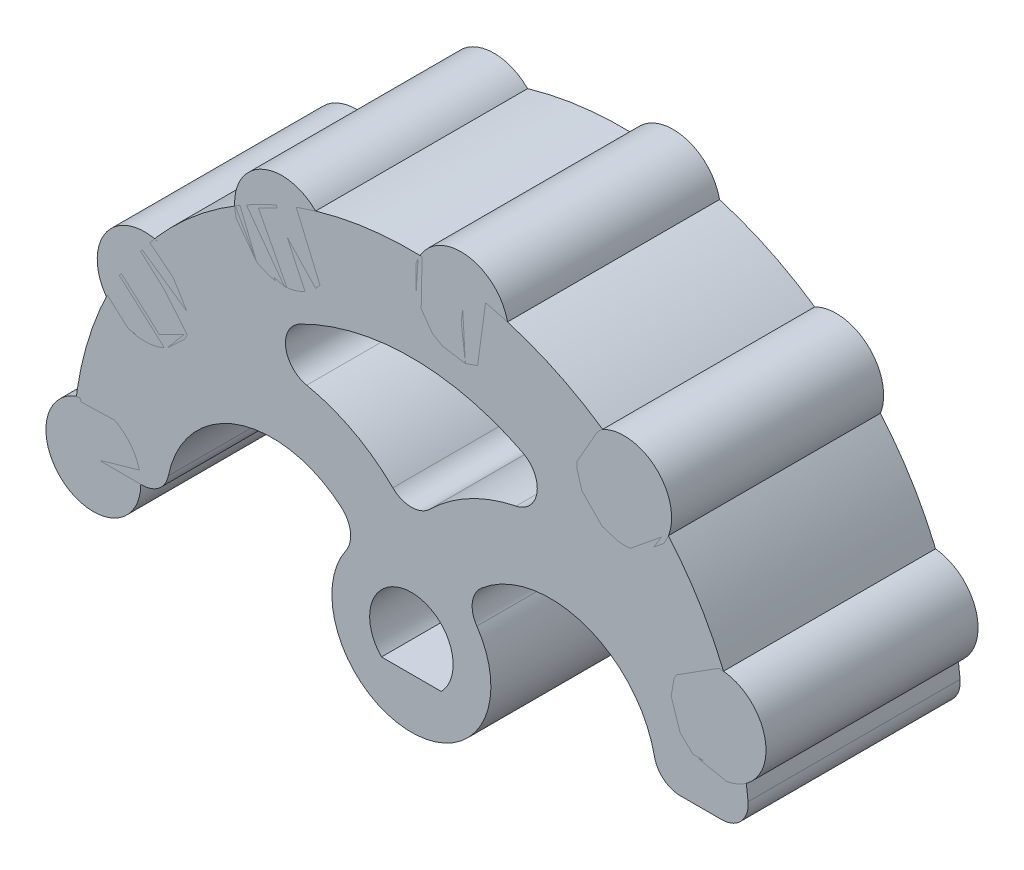
ISO-10303-21;
HEADER;
FILE_DESCRIPTION(('STEP AP214'),'2;1');
FILE_NAME('part.step','',(''),(''),'','','');
FILE_SCHEMA(('AUTOMOTIVE_DESIGN { 1 0 10303 214 1 1 1 1 }'));
ENDSEC;
DATA;
#1=APPLICATION_CONTEXT('core data for automotive mechanical design processes');
#2=APPLICATION_PROTOCOL_DEFINITION('international standard','automotive_design',2000,#1);
#3=PRODUCT_CONTEXT('',#1,'mechanical');
#4=PRODUCT('Part','Part','',(#3));
#5=PRODUCT_RELATED_PRODUCT_CATEGORY('part','',(#4));
#6=PRODUCT_DEFINITION_FORMATION('','',#4);
#7=PRODUCT_DEFINITION_CONTEXT('part definition',#1,'design');
#8=PRODUCT_DEFINITION('design','',#6,#7);
#9=PRODUCT_DEFINITION_SHAPE('','',#8);
#10=(LENGTH_UNIT() NAMED_UNIT(*) SI_UNIT(.MILLI.,.METRE.));
#11=(NAMED_UNIT(*) PLANE_ANGLE_UNIT() SI_UNIT($,.RADIAN.));
#12=(NAMED_UNIT(*) SI_UNIT($,.STERADIAN.) SOLID_ANGLE_UNIT());
#13=UNCERTAINTY_MEASURE_WITH_UNIT(LENGTH_MEASURE(1.E-05),#10,'distance_accuracy_value','');
#14=(GEOMETRIC_REPRESENTATION_CONTEXT(3) GLOBAL_UNCERTAINTY_ASSIGNED_CONTEXT((#13)) GLOBAL_UNIT_ASSIGNED_CONTEXT((#10,
#11,#12)) REPRESENTATION_CONTEXT('',''));
#15=CARTESIAN_POINT('',(0.,0.,0.));
#16=DIRECTION('',(0.,0.,1.));
#17=DIRECTION('',(1.,0.,0.));
#18=AXIS2_PLACEMENT_3D('',#15,#16,#17);
#19=CARTESIAN_POINT('',(11.5911099154688,3.10582854123019,0.));
#20=DIRECTION('',(0.,0.,1.));
#21=DIRECTION('',(-0.96592582628907,-0.258819045102516,0.));
#22=AXIS2_PLACEMENT_3D('',#19,#20,#21);
#23=CYLINDRICAL_SURFACE('',#22,1.78981093410736);
#24=CARTESIAN_POINT('',(11.5911099154688,3.10582854123019,0.));
#25=DIRECTION('',(0.,0.,1.));
#26=DIRECTION('',(-0.96592582628907,-0.258819045102516,0.));
#27=AXIS2_PLACEMENT_3D('',#24,#25,#26);
#28=CIRCLE('',#27,1.78981093410736);
#29=CARTESIAN_POINT('',(9.86228531003997,2.64259138435048,0.));
#30=VERTEX_POINT('',#29);
#31=EDGE_CURVE('P0_E11',#30,#30,#28,.T.);
#32=ORIENTED_EDGE('',*,*,#31,.T.);
#33=EDGE_LOOP('',(#32));
#34=FACE_BOUND('',#33,.T.);
#35=CARTESIAN_POINT('',(11.5911099154688,3.10582854123019,8.));
#36=DIRECTION('',(0.,0.,1.));
#37=DIRECTION('',(-0.96592582628907,-0.258819045102516,0.));
#38=AXIS2_PLACEMENT_3D('',#35,#36,#37);
#39=CIRCLE('',#38,1.78981093410736);
#40=CARTESIAN_POINT('',(9.86228531003997,2.64259138435048,8.));
#41=VERTEX_POINT('',#40);
#42=EDGE_CURVE('P0_E49',#41,#41,#39,.T.);
#43=ORIENTED_EDGE('',*,*,#42,.F.);
#44=EDGE_LOOP('',(#43));
#45=FACE_BOUND('',#44,.T.);
#46=ADVANCED_FACE('P0_F46',(#34,#45),#23,.T.);
#47=CARTESIAN_POINT('',(0.,0.,0.));
#48=DIRECTION('',(0.,0.,1.));
#49=DIRECTION('',(-0.96592582628907,-0.258819045102516,0.));
#50=AXIS2_PLACEMENT_3D('',#47,#48,#49);
#51=PLANE('',#50);
#52=ORIENTED_EDGE('',*,*,#31,.F.);
#53=EDGE_LOOP('',(#52));
#54=FACE_BOUND('',#53,.T.);
#55=ADVANCED_FACE('P0_F61',(#54),#51,.F.);
#56=CARTESIAN_POINT('',(0.,0.,8.));
#57=DIRECTION('',(0.,0.,1.));
#58=DIRECTION('',(-0.96592582628907,-0.258819045102516,0.));
#59=AXIS2_PLACEMENT_3D('',#56,#57,#58);
#60=PLANE('',#59);
#61=ORIENTED_EDGE('',*,*,#42,.T.);
#62=EDGE_LOOP('',(#61));
#63=FACE_BOUND('',#62,.T.);
#64=ADVANCED_FACE('P0_F58',(#63),#60,.T.);
#65=CLOSED_SHELL('',(#46,#55,#64));
#66=MANIFOLD_SOLID_BREP('P0_B2',#65);
#67=CARTESIAN_POINT('',(8.02956727630633,8.9177379057287,0.));
#68=DIRECTION('',(0.,0.,1.));
#69=DIRECTION('',(-0.669130606358861,-0.743144825477392,0.));
#70=AXIS2_PLACEMENT_3D('',#67,#68,#69);
#71=CYLINDRICAL_SURFACE('',#70,1.78981093410736);
#72=CARTESIAN_POINT('',(8.02956727630633,8.9177379057287,0.));
#73=DIRECTION('',(0.,0.,1.));
#74=DIRECTION('',(-0.669130606358861,-0.743144825477392,0.));
#75=AXIS2_PLACEMENT_3D('',#72,#73,#74);
#76=CIRCLE('',#75,1.78981093410736);
#77=CARTESIAN_POINT('',(6.83195000069935,7.58764917146395,0.));
#78=VERTEX_POINT('',#77);
#79=EDGE_CURVE('P0_E45',#78,#78,#76,.T.);
#80=ORIENTED_EDGE('',*,*,#79,.T.);
#81=EDGE_LOOP('',(#80));
#82=FACE_BOUND('',#81,.T.);
#83=CARTESIAN_POINT('',(8.02956727630633,8.9177379057287,8.));
#84=DIRECTION('',(0.,0.,1.));
#85=DIRECTION('',(-0.669130606358861,-0.743144825477392,0.));
#86=AXIS2_PLACEMENT_3D('',#83,#84,#85);
#87=CIRCLE('',#86,1.78981093410736);
#88=CARTESIAN_POINT('',(6.83195000069935,7.58764917146395,8.));
#89=VERTEX_POINT('',#88);
#90=EDGE_CURVE('P0_E118',#89,#89,#87,.T.);
#91=ORIENTED_EDGE('',*,*,#90,.F.);
#92=EDGE_LOOP('',(#91));
#93=FACE_BOUND('',#92,.T.);
#94=ADVANCED_FACE('P0_F115',(#82,#93),#71,.T.);
#95=CARTESIAN_POINT('',(0.,0.,0.));
#96=DIRECTION('',(0.,0.,1.));
#97=DIRECTION('',(-0.669130606358861,-0.743144825477392,0.));
#98=AXIS2_PLACEMENT_3D('',#95,#96,#97);
#99=PLANE('',#98);
#100=ORIENTED_EDGE('',*,*,#79,.F.);
#101=EDGE_LOOP('',(#100));
#102=FACE_BOUND('',#101,.T.);
#103=ADVANCED_FACE('P0_F130',(#102),#99,.F.);
#104=CARTESIAN_POINT('',(0.,0.,8.));
#105=DIRECTION('',(0.,0.,1.));
#106=DIRECTION('',(-0.669130606358861,-0.743144825477392,0.));
#107=AXIS2_PLACEMENT_3D('',#104,#105,#106);
#108=PLANE('',#107);
#109=ORIENTED_EDGE('',*,*,#90,.T.);
#110=EDGE_LOOP('',(#109));
#111=FACE_BOUND('',#110,.T.);
#112=ADVANCED_FACE('P0_F127',(#111),#108,.T.);
#113=CLOSED_SHELL('',(#94,#103,#112));
#114=MANIFOLD_SOLID_BREP('P0_B6',#113);
#115=CARTESIAN_POINT('',(1.87721358048281,11.8522600871416,0.));
#116=DIRECTION('',(0.,0.,1.));
#117=DIRECTION('',(-0.156434465040234,-0.987688340595137,0.));
#118=AXIS2_PLACEMENT_3D('',#115,#116,#117);
#119=CYLINDRICAL_SURFACE('',#118,1.78981093410736);
#120=CARTESIAN_POINT('',(1.87721358048281,11.8522600871416,0.));
#121=DIRECTION('',(0.,0.,1.));
#122=DIRECTION('',(-0.156434465040234,-0.987688340595137,0.));
#123=AXIS2_PLACEMENT_3D('',#120,#121,#122);
#124=CIRCLE('',#123,1.78981093410736);
#125=CARTESIAN_POINT('',(1.59722546448256,10.0844846956541,0.));
#126=VERTEX_POINT('',#125);
#127=EDGE_CURVE('P0_E114',#126,#126,#124,.T.);
#128=ORIENTED_EDGE('',*,*,#127,.T.);
#129=EDGE_LOOP('',(#128));
#130=FACE_BOUND('',#129,.T.);
#131=CARTESIAN_POINT('',(1.87721358048281,11.8522600871416,8.));
#132=DIRECTION('',(0.,0.,1.));
#133=DIRECTION('',(-0.156434465040234,-0.987688340595137,0.));
#134=AXIS2_PLACEMENT_3D('',#131,#132,#133);
#135=CIRCLE('',#134,1.78981093410736);
#136=CARTESIAN_POINT('',(1.59722546448256,10.0844846956541,8.));
#137=VERTEX_POINT('',#136);
#138=EDGE_CURVE('P0_E187',#137,#137,#135,.T.);
#139=ORIENTED_EDGE('',*,*,#138,.F.);
#140=EDGE_LOOP('',(#139));
#141=FACE_BOUND('',#140,.T.);
#142=ADVANCED_FACE('P0_F184',(#130,#141),#119,.T.);
#143=CARTESIAN_POINT('',(0.,0.,0.));
#144=DIRECTION('',(0.,0.,1.));
#145=DIRECTION('',(-0.156434465040234,-0.987688340595137,0.));
#146=AXIS2_PLACEMENT_3D('',#143,#144,#145);
#147=PLANE('',#146);
#148=ORIENTED_EDGE('',*,*,#127,.F.);
#149=EDGE_LOOP('',(#148));
#150=FACE_BOUND('',#149,.T.);
#151=ADVANCED_FACE('P0_F199',(#150),#147,.F.);
#152=CARTESIAN_POINT('',(0.,0.,8.));
#153=DIRECTION('',(0.,0.,1.));
#154=DIRECTION('',(-0.156434465040234,-0.987688340595137,0.));
#155=AXIS2_PLACEMENT_3D('',#152,#153,#154);
#156=PLANE('',#155);
#157=ORIENTED_EDGE('',*,*,#138,.T.);
#158=EDGE_LOOP('',(#157));
#159=FACE_BOUND('',#158,.T.);
#160=ADVANCED_FACE('P0_F196',(#159),#156,.T.);
#161=CLOSED_SHELL('',(#142,#151,#160));
#162=MANIFOLD_SOLID_BREP('P0_B40',#161);
#163=CARTESIAN_POINT('',(-4.88083971690958,10.9625454917112,0.));
#164=DIRECTION('',(0.,0.,1.));
#165=DIRECTION('',(0.406736643075798,-0.913545457642602,0.));
#166=AXIS2_PLACEMENT_3D('',#163,#164,#165);
#167=CYLINDRICAL_SURFACE('',#166,1.78981093410736);
#168=CARTESIAN_POINT('',(-4.88083971690958,10.9625454917112,0.));
#169=DIRECTION('',(0.,0.,1.));
#170=DIRECTION('',(0.406736643075798,-0.913545457642602,0.));
#171=AXIS2_PLACEMENT_3D('',#168,#169,#170);
#172=CIRCLE('',#171,1.78981093410736);
#173=CARTESIAN_POINT('',(-4.15285802583039,9.32747184281838,0.));
#174=VERTEX_POINT('',#173);
#175=EDGE_CURVE('P0_E183',#174,#174,#172,.T.);
#176=ORIENTED_EDGE('',*,*,#175,.T.);
#177=EDGE_LOOP('',(#176));
#178=FACE_BOUND('',#177,.T.);
#179=CARTESIAN_POINT('',(-4.88083971690958,10.9625454917112,8.));
#180=DIRECTION('',(0.,0.,1.));
#181=DIRECTION('',(0.406736643075798,-0.913545457642602,0.));
#182=AXIS2_PLACEMENT_3D('',#179,#180,#181);
#183=CIRCLE('',#182,1.78981093410736);
#184=CARTESIAN_POINT('',(-4.15285802583039,9.32747184281838,8.));
#185=VERTEX_POINT('',#184);
#186=EDGE_CURVE('P0_E256',#185,#185,#183,.T.);
#187=ORIENTED_EDGE('',*,*,#186,.F.);
#188=EDGE_LOOP('',(#187));
#189=FACE_BOUND('',#188,.T.);
#190=ADVANCED_FACE('P0_F253',(#178,#189),#167,.T.);
#191=CARTESIAN_POINT('',(0.,0.,0.));
#192=DIRECTION('',(0.,0.,1.));
#193=DIRECTION('',(0.406736643075798,-0.913545457642602,0.));
#194=AXIS2_PLACEMENT_3D('',#191,#192,#193);
#195=PLANE('',#194);
#196=ORIENTED_EDGE('',*,*,#175,.F.);
#197=EDGE_LOOP('',(#196));
#198=FACE_BOUND('',#197,.T.);
#199=ADVANCED_FACE('P0_F268',(#198),#195,.F.);
#200=CARTESIAN_POINT('',(0.,0.,8.));
#201=DIRECTION('',(0.,0.,1.));
#202=DIRECTION('',(0.406736643075798,-0.913545457642602,0.));
#203=AXIS2_PLACEMENT_3D('',#200,#201,#202);
#204=PLANE('',#203);
#205=ORIENTED_EDGE('',*,*,#186,.T.);
#206=EDGE_LOOP('',(#205));
#207=FACE_BOUND('',#206,.T.);
#208=ADVANCED_FACE('P0_F265',(#207),#204,.T.);
#209=CLOSED_SHELL('',(#190,#199,#208));
#210=MANIFOLD_SOLID_BREP('P0_B109',#209);
#211=CARTESIAN_POINT('',(-10.0640468153451,6.53566842018034,0.));
#212=DIRECTION('',(0.,0.,1.));
#213=DIRECTION('',(0.838670567945423,-0.544639035015028,0.));
#214=AXIS2_PLACEMENT_3D('',#211,#212,#213);
#215=CYLINDRICAL_SURFACE('',#214,1.78981093410736);
#216=CARTESIAN_POINT('',(-10.0640468153451,6.53566842018034,0.));
#217=DIRECTION('',(0.,0.,1.));
#218=DIRECTION('',(0.838670567945423,-0.544639035015028,0.));
#219=AXIS2_PLACEMENT_3D('',#216,#217,#218);
#220=CIRCLE('',#219,1.78981093410736);
#221=CARTESIAN_POINT('',(-8.56298506272233,5.56086752016876,0.));
#222=VERTEX_POINT('',#221);
#223=EDGE_CURVE('P0_E252',#222,#222,#220,.T.);
#224=ORIENTED_EDGE('',*,*,#223,.T.);
#225=EDGE_LOOP('',(#224));
#226=FACE_BOUND('',#225,.T.);
#227=CARTESIAN_POINT('',(-10.0640468153451,6.53566842018034,8.));
#228=DIRECTION('',(0.,0.,1.));
#229=DIRECTION('',(0.838670567945423,-0.544639035015028,0.));
#230=AXIS2_PLACEMENT_3D('',#227,#228,#229);
#231=CIRCLE('',#230,1.78981093410736);
#232=CARTESIAN_POINT('',(-8.56298506272233,5.56086752016876,8.));
#233=VERTEX_POINT('',#232);
#234=EDGE_CURVE('P0_E324',#233,#233,#231,.T.);
#235=ORIENTED_EDGE('',*,*,#234,.F.);
#236=EDGE_LOOP('',(#235));
#237=FACE_BOUND('',#236,.T.);
#238=ADVANCED_FACE('P0_F321',(#226,#237),#215,.T.);
#239=CARTESIAN_POINT('',(0.,0.,0.));
#240=DIRECTION('',(0.,0.,1.));
#241=DIRECTION('',(0.838670567945423,-0.544639035015028,0.));
#242=AXIS2_PLACEMENT_3D('',#239,#240,#241);
#243=PLANE('',#242);
#244=ORIENTED_EDGE('',*,*,#223,.F.);
#245=EDGE_LOOP('',(#244));
#246=FACE_BOUND('',#245,.T.);
#247=ADVANCED_FACE('P0_F336',(#246),#243,.F.);
#248=CARTESIAN_POINT('',(0.,0.,8.));
#249=DIRECTION('',(0.,0.,1.));
#250=DIRECTION('',(0.838670567945423,-0.544639035015028,0.));
#251=AXIS2_PLACEMENT_3D('',#248,#249,#250);
#252=PLANE('',#251);
#253=ORIENTED_EDGE('',*,*,#234,.T.);
#254=EDGE_LOOP('',(#253));
#255=FACE_BOUND('',#254,.T.);
#256=ADVANCED_FACE('P0_F333',(#255),#252,.T.);
#257=CLOSED_SHELL('',(#238,#247,#256));
#258=MANIFOLD_SOLID_BREP('P0_B178',#257);
#259=CARTESIAN_POINT('',(-12.,0.,0.));
#260=DIRECTION('',(0.,0.,1.));
#261=DIRECTION('',(1.,0.,0.));
#262=AXIS2_PLACEMENT_3D('',#259,#260,#261);
#263=CYLINDRICAL_SURFACE('',#262,1.78981093410736);
#264=CARTESIAN_POINT('',(-12.,0.,0.));
#265=DIRECTION('',(0.,0.,1.));
#266=DIRECTION('',(1.,0.,0.));
#267=AXIS2_PLACEMENT_3D('',#264,#265,#266);
#268=CIRCLE('',#267,1.78981093410736);
#269=CARTESIAN_POINT('',(-10.2101890658926,0.,0.));
#270=VERTEX_POINT('',#269);
#271=EDGE_CURVE('P0_E320',#270,#270,#268,.T.);
#272=ORIENTED_EDGE('',*,*,#271,.T.);
#273=EDGE_LOOP('',(#272));
#274=FACE_BOUND('',#273,.T.);
#275=CARTESIAN_POINT('',(-12.,0.,8.));
#276=DIRECTION('',(0.,0.,1.));
#277=DIRECTION('',(1.,0.,0.));
#278=AXIS2_PLACEMENT_3D('',#275,#276,#277);
#279=CIRCLE('',#278,1.78981093410736);
#280=CARTESIAN_POINT('',(-10.2101890658926,0.,8.));
#281=VERTEX_POINT('',#280);
#282=EDGE_CURVE('P0_E385',#281,#281,#279,.T.);
#283=ORIENTED_EDGE('',*,*,#282,.F.);
#284=EDGE_LOOP('',(#283));
#285=FACE_BOUND('',#284,.T.);
#286=ADVANCED_FACE('P0_F382',(#274,#285),#263,.T.);
#287=CARTESIAN_POINT('',(0.,0.,0.));
#288=DIRECTION('',(0.,0.,1.));
#289=DIRECTION('',(1.,0.,0.));
#290=AXIS2_PLACEMENT_3D('',#287,#288,#289);
#291=PLANE('',#290);
#292=ORIENTED_EDGE('',*,*,#271,.F.);
#293=EDGE_LOOP('',(#292));
#294=FACE_BOUND('',#293,.T.);
#295=ADVANCED_FACE('P0_F397',(#294),#291,.F.);
#296=CARTESIAN_POINT('',(0.,0.,8.));
#297=DIRECTION('',(0.,0.,1.));
#298=DIRECTION('',(1.,0.,0.));
#299=AXIS2_PLACEMENT_3D('',#296,#297,#298);
#300=PLANE('',#299);
#301=ORIENTED_EDGE('',*,*,#282,.T.);
#302=EDGE_LOOP('',(#301));
#303=FACE_BOUND('',#302,.T.);
#304=ADVANCED_FACE('P0_F394',(#303),#300,.T.);
#305=CLOSED_SHELL('',(#286,#295,#304));
#306=MANIFOLD_SOLID_BREP('P0_B247',#305);
#307=CARTESIAN_POINT('',(11.7073694739681,1.,8.));
#308=DIRECTION('',(0.,0.,1.));
#309=DIRECTION('',(1.,0.,0.));
#310=AXIS2_PLACEMENT_3D('',#307,#308,#309);
#311=CYLINDRICAL_SURFACE('',#310,1.);
#312=CARTESIAN_POINT('',(11.7073694739681,1.,8.));
#313=DIRECTION('',(0.,0.,-1.));
#314=DIRECTION('',(0.,-1.,0.));
#315=AXIS2_PLACEMENT_3D('',#312,#313,#314);
#316=CIRCLE('',#315,1.);
#317=CARTESIAN_POINT('',(12.703741344093,1.08510638297872,8.));
#318=VERTEX_POINT('',#317);
#319=CARTESIAN_POINT('',(11.7073694739681,0.,8.));
#320=VERTEX_POINT('',#319);
#321=EDGE_CURVE('P1_E11',#318,#320,#316,.T.);
#322=ORIENTED_EDGE('',*,*,#321,.T.);
#323=DIRECTION('',(0.,0.,-1.));
#324=VECTOR('',#323,1.);
#325=CARTESIAN_POINT('',(11.7073694739681,0.,8.));
#326=LINE('',#325,#324);
#327=CARTESIAN_POINT('',(11.7073694739681,0.,0.));
#328=VERTEX_POINT('',#327);
#329=EDGE_CURVE('P1_E27',#320,#328,#326,.T.);
#330=ORIENTED_EDGE('',*,*,#329,.T.);
#331=CARTESIAN_POINT('',(11.7073694739681,1.,0.));
#332=DIRECTION('',(0.,0.,1.));
#333=DIRECTION('',(1.,0.,0.));
#334=AXIS2_PLACEMENT_3D('',#331,#332,#333);
#335=CIRCLE('',#334,1.);
#336=CARTESIAN_POINT('',(12.703741344093,1.08510638297872,0.));
#337=VERTEX_POINT('',#336);
#338=EDGE_CURVE('P1_E325',#328,#337,#335,.T.);
#339=ORIENTED_EDGE('',*,*,#338,.T.);
#340=DIRECTION('',(0.,0.,1.));
#341=VECTOR('',#340,1.);
#342=CARTESIAN_POINT('',(12.703741344093,1.08510638297872,8.));
#343=LINE('',#342,#341);
#344=EDGE_CURVE('P1_E326',#337,#318,#343,.T.);
#345=ORIENTED_EDGE('',*,*,#344,.T.);
#346=EDGE_LOOP('',(#322,#330,#339,#345));
#347=FACE_BOUND('',#346,.T.);
#348=ADVANCED_FACE('P1_F17',(#347),#311,.T.);
#349=CARTESIAN_POINT('',(0.,0.,8.));
#350=DIRECTION('',(0.,0.,-1.));
#351=DIRECTION('',(0.,-1.,0.));
#352=AXIS2_PLACEMENT_3D('',#349,#350,#351);
#353=CYLINDRICAL_SURFACE('',#352,12.75);
#354=ORIENTED_EDGE('',*,*,#344,.F.);
#355=CARTESIAN_POINT('',(0.,0.,0.));
#356=DIRECTION('',(0.,0.,-1.));
#357=DIRECTION('',(0.,-1.,0.));
#358=AXIS2_PLACEMENT_3D('',#355,#356,#357);
#359=CIRCLE('',#358,12.75);
#360=CARTESIAN_POINT('',(-12.703741344093,1.08510638297872,0.));
#361=VERTEX_POINT('',#360);
#362=EDGE_CURVE('P1_E208',#361,#337,#359,.T.);
#363=ORIENTED_EDGE('',*,*,#362,.F.);
#364=DIRECTION('',(0.,0.,-1.));
#365=VECTOR('',#364,1.);
#366=CARTESIAN_POINT('',(-12.703741344093,1.08510638297872,8.));
#367=LINE('',#366,#365);
#368=CARTESIAN_POINT('',(-12.703741344093,1.08510638297872,8.));
#369=VERTEX_POINT('',#368);
#370=EDGE_CURVE('P1_E243',#369,#361,#367,.T.);
#371=ORIENTED_EDGE('',*,*,#370,.F.);
#372=CARTESIAN_POINT('',(0.,0.,8.));
#373=DIRECTION('',(0.,0.,1.));
#374=DIRECTION('',(0.,-1.,0.));
#375=AXIS2_PLACEMENT_3D('',#372,#373,#374);
#376=CIRCLE('',#375,12.75);
#377=EDGE_CURVE('P1_E304',#318,#369,#376,.T.);
#378=ORIENTED_EDGE('',*,*,#377,.F.);
#379=EDGE_LOOP('',(#354,#363,#371,#378));
#380=FACE_BOUND('',#379,.T.);
#381=ADVANCED_FACE('P1_F338',(#380),#353,.T.);
#382=CARTESIAN_POINT('',(0.,0.,0.));
#383=DIRECTION('',(0.,0.,1.));
#384=DIRECTION('',(1.,0.,0.));
#385=AXIS2_PLACEMENT_3D('',#382,#383,#384);
#386=PLANE('',#385);
#387=ORIENTED_EDGE('',*,*,#338,.F.);
#388=DIRECTION('',(-1.,0.,0.));
#389=VECTOR('',#388,1.);
#390=CARTESIAN_POINT('',(9.25,0.,0.));
#391=LINE('',#390,#389);
#392=CARTESIAN_POINT('',(10.1489794855664,0.,0.));
#393=VERTEX_POINT('',#392);
#394=EDGE_CURVE('P1_E183',#328,#393,#391,.T.);
#395=ORIENTED_EDGE('',*,*,#394,.T.);
#396=CARTESIAN_POINT('',(10.1489794855664,1.,0.));
#397=DIRECTION('',(0.,0.,1.));
#398=DIRECTION('',(1.,0.,0.));
#399=AXIS2_PLACEMENT_3D('',#396,#397,#398);
#400=CIRCLE('',#399,1.);
#401=CARTESIAN_POINT('',(9.16918358845309,0.800000000000001,0.));
#402=VERTEX_POINT('',#401);
#403=EDGE_CURVE('P1_E174',#402,#393,#400,.T.);
#404=ORIENTED_EDGE('',*,*,#403,.F.);
#405=CARTESIAN_POINT('',(5.25,0.,0.));
#406=DIRECTION('',(0.,0.,1.));
#407=DIRECTION('',(1.,0.,0.));
#408=AXIS2_PLACEMENT_3D('',#405,#406,#407);
#409=CIRCLE('',#408,4.);
#410=CARTESIAN_POINT('',(2.63888888888889,3.03019780962103,0.));
#411=VERTEX_POINT('',#410);
#412=EDGE_CURVE('P1_E185',#402,#411,#409,.T.);
#413=ORIENTED_EDGE('',*,*,#412,.T.);
#414=CARTESIAN_POINT('',(3.29166666666667,2.27264835721577,0.));
#415=DIRECTION('',(0.,0.,-1.));
#416=DIRECTION('',(0.,-1.,0.));
#417=AXIS2_PLACEMENT_3D('',#414,#415,#416);
#418=CIRCLE('',#417,1.);
#419=CARTESIAN_POINT('',(2.46875,1.70448626791183,0.));
#420=VERTEX_POINT('',#419);
#421=EDGE_CURVE('P1_E189',#420,#411,#418,.T.);
#422=ORIENTED_EDGE('',*,*,#421,.F.);
#423=CARTESIAN_POINT('',(0.,0.,0.));
#424=DIRECTION('',(0.,0.,-1.));
#425=DIRECTION('',(0.,-1.,0.));
#426=AXIS2_PLACEMENT_3D('',#423,#424,#425);
#427=CIRCLE('',#426,3.);
#428=CARTESIAN_POINT('',(-2.46875,1.70448626791183,0.));
#429=VERTEX_POINT('',#428);
#430=EDGE_CURVE('P1_E188',#420,#429,#427,.T.);
#431=ORIENTED_EDGE('',*,*,#430,.T.);
#432=CARTESIAN_POINT('',(-3.29166666666667,2.27264835721577,0.));
#433=DIRECTION('',(0.,0.,-1.));
#434=DIRECTION('',(0.,-1.,0.));
#435=AXIS2_PLACEMENT_3D('',#432,#433,#434);
#436=CIRCLE('',#435,1.);
#437=CARTESIAN_POINT('',(-2.63888888888889,3.03019780962103,0.));
#438=VERTEX_POINT('',#437);
#439=EDGE_CURVE('P1_E196',#438,#429,#436,.T.);
#440=ORIENTED_EDGE('',*,*,#439,.F.);
#441=CARTESIAN_POINT('',(-5.25,0.,0.));
#442=DIRECTION('',(0.,0.,1.));
#443=DIRECTION('',(1.,0.,0.));
#444=AXIS2_PLACEMENT_3D('',#441,#442,#443);
#445=CIRCLE('',#444,4.);
#446=CARTESIAN_POINT('',(-9.16918358845309,0.8,0.));
#447=VERTEX_POINT('',#446);
#448=EDGE_CURVE('P1_E195',#438,#447,#445,.T.);
#449=ORIENTED_EDGE('',*,*,#448,.T.);
#450=CARTESIAN_POINT('',(-10.1489794855664,1.,0.));
#451=DIRECTION('',(0.,0.,1.));
#452=DIRECTION('',(1.,0.,0.));
#453=AXIS2_PLACEMENT_3D('',#450,#451,#452);
#454=CIRCLE('',#453,1.);
#455=CARTESIAN_POINT('',(-10.1489794855664,0.,0.));
#456=VERTEX_POINT('',#455);
#457=EDGE_CURVE('P1_E202',#456,#447,#454,.T.);
#458=ORIENTED_EDGE('',*,*,#457,.F.);
#459=DIRECTION('',(-1.,0.,0.));
#460=VECTOR('',#459,1.);
#461=CARTESIAN_POINT('',(-11.75,0.,0.));
#462=LINE('',#461,#460);
#463=CARTESIAN_POINT('',(-11.7073694739681,0.,0.));
#464=VERTEX_POINT('',#463);
#465=EDGE_CURVE('P1_E201',#456,#464,#462,.T.);
#466=ORIENTED_EDGE('',*,*,#465,.T.);
#467=CARTESIAN_POINT('',(-11.7073694739681,0.999999999999999,0.));
#468=DIRECTION('',(0.,0.,1.));
#469=DIRECTION('',(1.,0.,0.));
#470=AXIS2_PLACEMENT_3D('',#467,#468,#469);
#471=CIRCLE('',#470,1.);
#472=EDGE_CURVE('P1_E209',#361,#464,#471,.T.);
#473=ORIENTED_EDGE('',*,*,#472,.F.);
#474=ORIENTED_EDGE('',*,*,#362,.T.);
#475=EDGE_LOOP('',(#387,#395,#404,#413,#422,#431,#440,#449,#458,#466,#473,#474));
#476=FACE_BOUND('',#475,.T.);
#477=CARTESIAN_POINT('',(5.25,0.,0.));
#478=DIRECTION('',(0.,0.,-1.));
#479=DIRECTION('',(0.,-1.,0.));
#480=AXIS2_PLACEMENT_3D('',#477,#478,#479);
#481=CIRCLE('',#480,6.5);
#482=CARTESIAN_POINT('',(0.700000000000001,4.64192847855285,0.));
#483=VERTEX_POINT('',#482);
#484=CARTESIAN_POINT('',(3.95,6.36867333123626,0.));
#485=VERTEX_POINT('',#484);
#486=EDGE_CURVE('P1_E213',#483,#485,#481,.T.);
#487=ORIENTED_EDGE('',*,*,#486,.T.);
#488=CARTESIAN_POINT('',(3.75,7.34846922834953,0.));
#489=DIRECTION('',(0.,0.,-1.));
#490=DIRECTION('',(0.,-1.,0.));
#491=AXIS2_PLACEMENT_3D('',#488,#489,#490);
#492=CIRCLE('',#491,1.);
#493=CARTESIAN_POINT('',(4.20454545454546,8.23919277117978,0.));
#494=VERTEX_POINT('',#493);
#495=EDGE_CURVE('P1_E217',#494,#485,#492,.T.);
#496=ORIENTED_EDGE('',*,*,#495,.F.);
#497=CARTESIAN_POINT('',(0.,0.,0.));
#498=DIRECTION('',(0.,0.,1.));
#499=DIRECTION('',(1.,0.,0.));
#500=AXIS2_PLACEMENT_3D('',#497,#498,#499);
#501=CIRCLE('',#500,9.25);
#502=CARTESIAN_POINT('',(-4.20454545454546,8.23919277117978,0.));
#503=VERTEX_POINT('',#502);
#504=EDGE_CURVE('P1_E216',#494,#503,#501,.T.);
#505=ORIENTED_EDGE('',*,*,#504,.T.);
#506=CARTESIAN_POINT('',(-3.75,7.34846922834953,0.));
#507=DIRECTION('',(0.,0.,-1.));
#508=DIRECTION('',(0.,-1.,0.));
#509=AXIS2_PLACEMENT_3D('',#506,#507,#508);
#510=CIRCLE('',#509,1.);
#511=CARTESIAN_POINT('',(-3.95,6.36867333123626,0.));
#512=VERTEX_POINT('',#511);
#513=EDGE_CURVE('P1_E224',#512,#503,#510,.T.);
#514=ORIENTED_EDGE('',*,*,#513,.F.);
#515=CARTESIAN_POINT('',(-5.25,0.,0.));
#516=DIRECTION('',(0.,0.,-1.));
#517=DIRECTION('',(0.,-1.,0.));
#518=AXIS2_PLACEMENT_3D('',#515,#516,#517);
#519=CIRCLE('',#518,6.5);
#520=CARTESIAN_POINT('',(-0.7,4.64192847855285,0.));
#521=VERTEX_POINT('',#520);
#522=EDGE_CURVE('P1_E223',#512,#521,#519,.T.);
#523=ORIENTED_EDGE('',*,*,#522,.T.);
#524=CARTESIAN_POINT('',(0.,5.35607132140714,0.));
#525=DIRECTION('',(0.,0.,-1.));
#526=DIRECTION('',(0.,-1.,0.));
#527=AXIS2_PLACEMENT_3D('',#524,#525,#526);
#528=CIRCLE('',#527,1.);
#529=EDGE_CURVE('P1_E231',#483,#521,#528,.T.);
#530=ORIENTED_EDGE('',*,*,#529,.F.);
#531=EDGE_LOOP('',(#487,#496,#505,#514,#523,#530));
#532=FACE_BOUND('',#531,.T.);
#533=CARTESIAN_POINT('',(0.,0.,0.));
#534=DIRECTION('',(0.,0.,1.));
#535=DIRECTION('',(1.,0.,0.));
#536=AXIS2_PLACEMENT_3D('',#533,#534,#535);
#537=CIRCLE('',#536,1.575);
#538=CARTESIAN_POINT('',(1.12722003175955,-1.1,0.));
#539=VERTEX_POINT('',#538);
#540=CARTESIAN_POINT('',(-1.12722003175955,-1.1,0.));
#541=VERTEX_POINT('',#540);
#542=EDGE_CURVE('P1_E230',#539,#541,#537,.T.);
#543=ORIENTED_EDGE('',*,*,#542,.T.);
#544=DIRECTION('',(1.,0.,0.));
#545=VECTOR('',#544,1.);
#546=CARTESIAN_POINT('',(1.12722003175955,-1.1,0.));
#547=LINE('',#546,#545);
#548=EDGE_CURVE('P1_E211',#541,#539,#547,.T.);
#549=ORIENTED_EDGE('',*,*,#548,.T.);
#550=EDGE_LOOP('',(#543,#549));
#551=FACE_BOUND('',#550,.T.);
#552=ADVANCED_FACE('P1_F321',(#476,#532,#551),#386,.F.);
#553=CARTESIAN_POINT('',(-11.7073694739681,0.999999999999999,8.));
#554=DIRECTION('',(0.,0.,-1.));
#555=DIRECTION('',(0.,-1.,0.));
#556=AXIS2_PLACEMENT_3D('',#553,#554,#555);
#557=CYLINDRICAL_SURFACE('',#556,1.);
#558=ORIENTED_EDGE('',*,*,#472,.T.);
#559=DIRECTION('',(0.,0.,1.));
#560=VECTOR('',#559,1.);
#561=CARTESIAN_POINT('',(-11.7073694739681,0.,8.));
#562=LINE('',#561,#560);
#563=CARTESIAN_POINT('',(-11.7073694739681,0.,8.));
#564=VERTEX_POINT('',#563);
#565=EDGE_CURVE('P1_E212',#464,#564,#562,.T.);
#566=ORIENTED_EDGE('',*,*,#565,.T.);
#567=CARTESIAN_POINT('',(-11.7073694739681,0.999999999999999,8.));
#568=DIRECTION('',(0.,0.,-1.));
#569=DIRECTION('',(0.,-1.,0.));
#570=AXIS2_PLACEMENT_3D('',#567,#568,#569);
#571=CIRCLE('',#570,1.);
#572=EDGE_CURVE('P1_E240',#564,#369,#571,.T.);
#573=ORIENTED_EDGE('',*,*,#572,.T.);
#574=ORIENTED_EDGE('',*,*,#370,.T.);
#575=EDGE_LOOP('',(#558,#566,#573,#574));
#576=FACE_BOUND('',#575,.T.);
#577=ADVANCED_FACE('P1_F341',(#576),#557,.T.);
#578=CARTESIAN_POINT('',(-1.12722003175955,-1.1,8.));
#579=DIRECTION('',(0.,1.,0.));
#580=DIRECTION('',(0.,0.,1.));
#581=AXIS2_PLACEMENT_3D('',#578,#579,#580);
#582=PLANE('',#581);
#583=DIRECTION('',(-1.,0.,0.));
#584=VECTOR('',#583,1.);
#585=CARTESIAN_POINT('',(1.12722003175955,-1.1,8.));
#586=LINE('',#585,#584);
#587=CARTESIAN_POINT('',(1.12722003175955,-1.1,8.));
#588=VERTEX_POINT('',#587);
#589=CARTESIAN_POINT('',(-1.12722003175955,-1.1,8.));
#590=VERTEX_POINT('',#589);
#591=EDGE_CURVE('P1_E244',#588,#590,#586,.T.);
#592=ORIENTED_EDGE('',*,*,#591,.F.);
#593=DIRECTION('',(0.,0.,1.));
#594=VECTOR('',#593,1.);
#595=CARTESIAN_POINT('',(1.12722003175955,-1.1,0.));
#596=LINE('',#595,#594);
#597=EDGE_CURVE('P1_E247',#539,#588,#596,.T.);
#598=ORIENTED_EDGE('',*,*,#597,.F.);
#599=ORIENTED_EDGE('',*,*,#548,.F.);
#600=DIRECTION('',(0.,0.,-1.));
#601=VECTOR('',#600,1.);
#602=CARTESIAN_POINT('',(-1.12722003175955,-1.1,0.));
#603=LINE('',#602,#601);
#604=EDGE_CURVE('P1_E250',#590,#541,#603,.T.);
#605=ORIENTED_EDGE('',*,*,#604,.F.);
#606=EDGE_LOOP('',(#592,#598,#599,#605));
#607=FACE_BOUND('',#606,.T.);
#608=ADVANCED_FACE('P1_F382',(#607),#582,.T.);
#609=CARTESIAN_POINT('',(0.,0.,0.));
#610=DIRECTION('',(0.,0.,1.));
#611=DIRECTION('',(1.,0.,0.));
#612=AXIS2_PLACEMENT_3D('',#609,#610,#611);
#613=CYLINDRICAL_SURFACE('',#612,1.575);
#614=ORIENTED_EDGE('',*,*,#597,.T.);
#615=CARTESIAN_POINT('',(0.,0.,8.));
#616=DIRECTION('',(0.,0.,-1.));
#617=DIRECTION('',(0.,-1.,0.));
#618=AXIS2_PLACEMENT_3D('',#615,#616,#617);
#619=CIRCLE('',#618,1.575);
#620=EDGE_CURVE('P1_E172',#590,#588,#619,.T.);
#621=ORIENTED_EDGE('',*,*,#620,.F.);
#622=ORIENTED_EDGE('',*,*,#604,.T.);
#623=ORIENTED_EDGE('',*,*,#542,.F.);
#624=EDGE_LOOP('',(#614,#621,#622,#623));
#625=FACE_BOUND('',#624,.T.);
#626=ADVANCED_FACE('P1_F379',(#625),#613,.F.);
#627=CARTESIAN_POINT('',(3.75,7.34846922834953,8.));
#628=DIRECTION('',(0.,0.,-1.));
#629=DIRECTION('',(0.,-1.,0.));
#630=AXIS2_PLACEMENT_3D('',#627,#628,#629);
#631=CYLINDRICAL_SURFACE('',#630,1.);
#632=CARTESIAN_POINT('',(3.75,7.34846922834953,8.));
#633=DIRECTION('',(0.,0.,1.));
#634=DIRECTION('',(1.,0.,0.));
#635=AXIS2_PLACEMENT_3D('',#632,#633,#634);
#636=CIRCLE('',#635,1.);
#637=CARTESIAN_POINT('',(3.95,6.36867333123626,8.));
#638=VERTEX_POINT('',#637);
#639=CARTESIAN_POINT('',(4.20454545454546,8.23919277117978,8.));
#640=VERTEX_POINT('',#639);
#641=EDGE_CURVE('P1_E253',#638,#640,#636,.T.);
#642=ORIENTED_EDGE('',*,*,#641,.T.);
#643=DIRECTION('',(0.,0.,-1.));
#644=VECTOR('',#643,1.);
#645=CARTESIAN_POINT('',(4.20454545454546,8.23919277117978,8.));
#646=LINE('',#645,#644);
#647=EDGE_CURVE('P1_E219',#640,#494,#646,.T.);
#648=ORIENTED_EDGE('',*,*,#647,.T.);
#649=ORIENTED_EDGE('',*,*,#495,.T.);
#650=DIRECTION('',(0.,0.,1.));
#651=VECTOR('',#650,1.);
#652=CARTESIAN_POINT('',(3.95,6.36867333123626,8.));
#653=LINE('',#652,#651);
#654=EDGE_CURVE('P1_E220',#485,#638,#653,.T.);
#655=ORIENTED_EDGE('',*,*,#654,.T.);
#656=EDGE_LOOP('',(#642,#648,#649,#655));
#657=FACE_BOUND('',#656,.T.);
#658=ADVANCED_FACE('P1_F381',(#657),#631,.F.);
#659=CARTESIAN_POINT('',(0.,0.,8.));
#660=DIRECTION('',(0.,0.,-1.));
#661=DIRECTION('',(0.,-1.,0.));
#662=AXIS2_PLACEMENT_3D('',#659,#660,#661);
#663=CYLINDRICAL_SURFACE('',#662,9.25);
#664=ORIENTED_EDGE('',*,*,#647,.F.);
#665=CARTESIAN_POINT('',(0.,0.,8.));
#666=DIRECTION('',(0.,0.,-1.));
#667=DIRECTION('',(0.,-1.,0.));
#668=AXIS2_PLACEMENT_3D('',#665,#666,#667);
#669=CIRCLE('',#668,9.25);
#670=CARTESIAN_POINT('',(-4.20454545454546,8.23919277117978,8.));
#671=VERTEX_POINT('',#670);
#672=EDGE_CURVE('P1_E176',#671,#640,#669,.T.);
#673=ORIENTED_EDGE('',*,*,#672,.F.);
#674=DIRECTION('',(0.,0.,1.));
#675=VECTOR('',#674,1.);
#676=CARTESIAN_POINT('',(-4.20454545454546,8.23919277117978,8.));
#677=LINE('',#676,#675);
#678=EDGE_CURVE('P1_E227',#503,#671,#677,.T.);
#679=ORIENTED_EDGE('',*,*,#678,.F.);
#680=ORIENTED_EDGE('',*,*,#504,.F.);
#681=EDGE_LOOP('',(#664,#673,#679,#680));
#682=FACE_BOUND('',#681,.T.);
#683=ADVANCED_FACE('P1_F385',(#682),#663,.F.);
#684=CARTESIAN_POINT('',(-3.75,7.34846922834953,8.));
#685=DIRECTION('',(0.,0.,-1.));
#686=DIRECTION('',(0.,-1.,0.));
#687=AXIS2_PLACEMENT_3D('',#684,#685,#686);
#688=CYLINDRICAL_SURFACE('',#687,1.);
#689=CARTESIAN_POINT('',(-3.75,7.34846922834953,8.));
#690=DIRECTION('',(0.,0.,1.));
#691=DIRECTION('',(1.,0.,0.));
#692=AXIS2_PLACEMENT_3D('',#689,#690,#691);
#693=CIRCLE('',#692,1.);
#694=CARTESIAN_POINT('',(-3.95,6.36867333123626,8.));
#695=VERTEX_POINT('',#694);
#696=EDGE_CURVE('P1_E260',#671,#695,#693,.T.);
#697=ORIENTED_EDGE('',*,*,#696,.T.);
#698=DIRECTION('',(0.,0.,-1.));
#699=VECTOR('',#698,1.);
#700=CARTESIAN_POINT('',(-3.95,6.36867333123626,8.));
#701=LINE('',#700,#699);
#702=EDGE_CURVE('P1_E226',#695,#512,#701,.T.);
#703=ORIENTED_EDGE('',*,*,#702,.T.);
#704=ORIENTED_EDGE('',*,*,#513,.T.);
#705=ORIENTED_EDGE('',*,*,#678,.T.);
#706=EDGE_LOOP('',(#697,#703,#704,#705));
#707=FACE_BOUND('',#706,.T.);
#708=ADVANCED_FACE('P1_F377',(#707),#688,.F.);
#709=CARTESIAN_POINT('',(-5.25,0.,8.));
#710=DIRECTION('',(0.,0.,-1.));
#711=DIRECTION('',(0.,-1.,0.));
#712=AXIS2_PLACEMENT_3D('',#709,#710,#711);
#713=CYLINDRICAL_SURFACE('',#712,6.5);
#714=ORIENTED_EDGE('',*,*,#702,.F.);
#715=CARTESIAN_POINT('',(-5.25,0.,8.));
#716=DIRECTION('',(0.,0.,1.));
#717=DIRECTION('',(1.,0.,0.));
#718=AXIS2_PLACEMENT_3D('',#715,#716,#717);
#719=CIRCLE('',#718,6.5);
#720=CARTESIAN_POINT('',(-0.7,4.64192847855285,8.));
#721=VERTEX_POINT('',#720);
#722=EDGE_CURVE('P1_E179',#721,#695,#719,.T.);
#723=ORIENTED_EDGE('',*,*,#722,.F.);
#724=DIRECTION('',(0.,0.,1.));
#725=VECTOR('',#724,1.);
#726=CARTESIAN_POINT('',(-0.7,4.64192847855285,8.));
#727=LINE('',#726,#725);
#728=EDGE_CURVE('P1_E234',#521,#721,#727,.T.);
#729=ORIENTED_EDGE('',*,*,#728,.F.);
#730=ORIENTED_EDGE('',*,*,#522,.F.);
#731=EDGE_LOOP('',(#714,#723,#729,#730));
#732=FACE_BOUND('',#731,.T.);
#733=ADVANCED_FACE('P1_F374',(#732),#713,.T.);
#734=CARTESIAN_POINT('',(0.,5.35607132140714,8.));
#735=DIRECTION('',(0.,0.,-1.));
#736=DIRECTION('',(0.,-1.,0.));
#737=AXIS2_PLACEMENT_3D('',#734,#735,#736);
#738=CYLINDRICAL_SURFACE('',#737,1.);
#739=CARTESIAN_POINT('',(0.,5.35607132140714,8.));
#740=DIRECTION('',(0.,0.,1.));
#741=DIRECTION('',(1.,0.,0.));
#742=AXIS2_PLACEMENT_3D('',#739,#740,#741);
#743=CIRCLE('',#742,1.);
#744=CARTESIAN_POINT('',(0.700000000000001,4.64192847855285,8.));
#745=VERTEX_POINT('',#744);
#746=EDGE_CURVE('P1_E264',#721,#745,#743,.T.);
#747=ORIENTED_EDGE('',*,*,#746,.T.);
#748=DIRECTION('',(0.,0.,-1.));
#749=VECTOR('',#748,1.);
#750=CARTESIAN_POINT('',(0.7,4.64192847855285,8.));
#751=LINE('',#750,#749);
#752=EDGE_CURVE('P1_E233',#745,#483,#751,.T.);
#753=ORIENTED_EDGE('',*,*,#752,.T.);
#754=ORIENTED_EDGE('',*,*,#529,.T.);
#755=ORIENTED_EDGE('',*,*,#728,.T.);
#756=EDGE_LOOP('',(#747,#753,#754,#755));
#757=FACE_BOUND('',#756,.T.);
#758=ADVANCED_FACE('P1_F19',(#757),#738,.F.);
#759=CARTESIAN_POINT('',(5.25,0.,8.));
#760=DIRECTION('',(0.,0.,-1.));
#761=DIRECTION('',(0.,-1.,0.));
#762=AXIS2_PLACEMENT_3D('',#759,#760,#761);
#763=CYLINDRICAL_SURFACE('',#762,6.5);
#764=ORIENTED_EDGE('',*,*,#654,.F.);
#765=ORIENTED_EDGE('',*,*,#486,.F.);
#766=ORIENTED_EDGE('',*,*,#752,.F.);
#767=CARTESIAN_POINT('',(5.25,0.,8.));
#768=DIRECTION('',(0.,0.,1.));
#769=DIRECTION('',(1.,0.,0.));
#770=AXIS2_PLACEMENT_3D('',#767,#768,#769);
#771=CIRCLE('',#770,6.5);
#772=EDGE_CURVE('P1_E246',#638,#745,#771,.T.);
#773=ORIENTED_EDGE('',*,*,#772,.F.);
#774=EDGE_LOOP('',(#764,#765,#766,#773));
#775=FACE_BOUND('',#774,.T.);
#776=ADVANCED_FACE('P1_F354',(#775),#763,.T.);
#777=CARTESIAN_POINT('',(-3.29166666666667,2.27264835721577,0.));
#778=DIRECTION('',(0.,0.,-1.));
#779=DIRECTION('',(0.,-1.,0.));
#780=AXIS2_PLACEMENT_3D('',#777,#778,#779);
#781=CYLINDRICAL_SURFACE('',#780,1.);
#782=CARTESIAN_POINT('',(-3.29166666666667,2.27264835721577,8.));
#783=DIRECTION('',(0.,0.,1.));
#784=DIRECTION('',(1.,0.,0.));
#785=AXIS2_PLACEMENT_3D('',#782,#783,#784);
#786=CIRCLE('',#785,1.);
#787=CARTESIAN_POINT('',(-2.46875,1.70448626791183,8.));
#788=VERTEX_POINT('',#787);
#789=CARTESIAN_POINT('',(-2.63888888888889,3.03019780962103,8.));
#790=VERTEX_POINT('',#789);
#791=EDGE_CURVE('P1_E273',#788,#790,#786,.T.);
#792=ORIENTED_EDGE('',*,*,#791,.T.);
#793=DIRECTION('',(0.,0.,-1.));
#794=VECTOR('',#793,1.);
#795=CARTESIAN_POINT('',(-2.63888888888889,3.03019780962103,0.));
#796=LINE('',#795,#794);
#797=EDGE_CURVE('P1_E198',#790,#438,#796,.T.);
#798=ORIENTED_EDGE('',*,*,#797,.T.);
#799=ORIENTED_EDGE('',*,*,#439,.T.);
#800=DIRECTION('',(0.,0.,1.));
#801=VECTOR('',#800,1.);
#802=CARTESIAN_POINT('',(-2.46875,1.70448626791183,0.));
#803=LINE('',#802,#801);
#804=EDGE_CURVE('P1_E191',#429,#788,#803,.T.);
#805=ORIENTED_EDGE('',*,*,#804,.T.);
#806=EDGE_LOOP('',(#792,#798,#799,#805));
#807=FACE_BOUND('',#806,.T.);
#808=ADVANCED_FACE('P1_F352',(#807),#781,.F.);
#809=CARTESIAN_POINT('',(-5.25,0.,8.));
#810=DIRECTION('',(0.,0.,-1.));
#811=DIRECTION('',(0.,-1.,0.));
#812=AXIS2_PLACEMENT_3D('',#809,#810,#811);
#813=CYLINDRICAL_SURFACE('',#812,4.);
#814=ORIENTED_EDGE('',*,*,#797,.F.);
#815=CARTESIAN_POINT('',(-5.25,0.,8.));
#816=DIRECTION('',(0.,0.,-1.));
#817=DIRECTION('',(0.,-1.,0.));
#818=AXIS2_PLACEMENT_3D('',#815,#816,#817);
#819=CIRCLE('',#818,4.);
#820=CARTESIAN_POINT('',(-9.16918358845309,0.8,8.));
#821=VERTEX_POINT('',#820);
#822=EDGE_CURVE('P1_E285',#821,#790,#819,.T.);
#823=ORIENTED_EDGE('',*,*,#822,.F.);
#824=DIRECTION('',(0.,0.,1.));
#825=VECTOR('',#824,1.);
#826=CARTESIAN_POINT('',(-9.16918358845309,0.8,8.));
#827=LINE('',#826,#825);
#828=EDGE_CURVE('P1_E205',#447,#821,#827,.T.);
#829=ORIENTED_EDGE('',*,*,#828,.F.);
#830=ORIENTED_EDGE('',*,*,#448,.F.);
#831=EDGE_LOOP('',(#814,#823,#829,#830));
#832=FACE_BOUND('',#831,.T.);
#833=ADVANCED_FACE('P1_F350',(#832),#813,.F.);
#834=CARTESIAN_POINT('',(3.29166666666667,2.27264835721577,0.));
#835=DIRECTION('',(0.,0.,1.));
#836=DIRECTION('',(1.,0.,0.));
#837=AXIS2_PLACEMENT_3D('',#834,#835,#836);
#838=CYLINDRICAL_SURFACE('',#837,1.);
#839=ORIENTED_EDGE('',*,*,#421,.T.);
#840=DIRECTION('',(0.,0.,1.));
#841=VECTOR('',#840,1.);
#842=CARTESIAN_POINT('',(2.63888888888889,3.03019780962103,0.));
#843=LINE('',#842,#841);
#844=CARTESIAN_POINT('',(2.63888888888889,3.03019780962103,8.));
#845=VERTEX_POINT('',#844);
#846=EDGE_CURVE('P1_E192',#411,#845,#843,.T.);
#847=ORIENTED_EDGE('',*,*,#846,.T.);
#848=CARTESIAN_POINT('',(3.29166666666667,2.27264835721577,8.));
#849=DIRECTION('',(0.,0.,1.));
#850=DIRECTION('',(1.,0.,0.));
#851=AXIS2_PLACEMENT_3D('',#848,#849,#850);
#852=CIRCLE('',#851,1.);
#853=CARTESIAN_POINT('',(2.46875,1.70448626791183,8.));
#854=VERTEX_POINT('',#853);
#855=EDGE_CURVE('P1_E295',#845,#854,#852,.T.);
#856=ORIENTED_EDGE('',*,*,#855,.T.);
#857=DIRECTION('',(0.,0.,-1.));
#858=VECTOR('',#857,1.);
#859=CARTESIAN_POINT('',(2.46875,1.70448626791183,0.));
#860=LINE('',#859,#858);
#861=EDGE_CURVE('P1_E204',#854,#420,#860,.T.);
#862=ORIENTED_EDGE('',*,*,#861,.T.);
#863=EDGE_LOOP('',(#839,#847,#856,#862));
#864=FACE_BOUND('',#863,.T.);
#865=ADVANCED_FACE('P1_F315',(#864),#838,.F.);
#866=CARTESIAN_POINT('',(5.25,0.,8.));
#867=DIRECTION('',(0.,0.,-1.));
#868=DIRECTION('',(0.,-1.,0.));
#869=AXIS2_PLACEMENT_3D('',#866,#867,#868);
#870=CYLINDRICAL_SURFACE('',#869,4.);
#871=ORIENTED_EDGE('',*,*,#846,.F.);
#872=ORIENTED_EDGE('',*,*,#412,.F.);
#873=DIRECTION('',(0.,0.,-1.));
#874=VECTOR('',#873,1.);
#875=CARTESIAN_POINT('',(9.16918358845309,0.800000000000001,8.));
#876=LINE('',#875,#874);
#877=CARTESIAN_POINT('',(9.16918358845309,0.800000000000001,8.));
#878=VERTEX_POINT('',#877);
#879=EDGE_CURVE('P1_E168',#878,#402,#876,.T.);
#880=ORIENTED_EDGE('',*,*,#879,.F.);
#881=CARTESIAN_POINT('',(5.25,0.,8.));
#882=DIRECTION('',(0.,0.,-1.));
#883=DIRECTION('',(0.,-1.,0.));
#884=AXIS2_PLACEMENT_3D('',#881,#882,#883);
#885=CIRCLE('',#884,4.);
#886=EDGE_CURVE('P1_E164',#845,#878,#885,.T.);
#887=ORIENTED_EDGE('',*,*,#886,.F.);
#888=EDGE_LOOP('',(#871,#872,#880,#887));
#889=FACE_BOUND('',#888,.T.);
#890=ADVANCED_FACE('P1_F319',(#889),#870,.F.);
#891=CARTESIAN_POINT('',(-10.1489794855664,1.,8.));
#892=DIRECTION('',(0.,0.,-1.));
#893=DIRECTION('',(0.,-1.,0.));
#894=AXIS2_PLACEMENT_3D('',#891,#892,#893);
#895=CYLINDRICAL_SURFACE('',#894,1.);
#896=ORIENTED_EDGE('',*,*,#457,.T.);
#897=ORIENTED_EDGE('',*,*,#828,.T.);
#898=CARTESIAN_POINT('',(-10.1489794855664,1.,8.));
#899=DIRECTION('',(0.,0.,-1.));
#900=DIRECTION('',(0.,-1.,0.));
#901=AXIS2_PLACEMENT_3D('',#898,#899,#900);
#902=CIRCLE('',#901,1.);
#903=CARTESIAN_POINT('',(-10.1489794855664,0.,8.));
#904=VERTEX_POINT('',#903);
#905=EDGE_CURVE('P1_E292',#821,#904,#902,.T.);
#906=ORIENTED_EDGE('',*,*,#905,.T.);
#907=DIRECTION('',(0.,0.,-1.));
#908=VECTOR('',#907,1.);
#909=CARTESIAN_POINT('',(-10.1489794855664,0.,8.));
#910=LINE('',#909,#908);
#911=EDGE_CURVE('P1_E151',#904,#456,#910,.T.);
#912=ORIENTED_EDGE('',*,*,#911,.T.);
#913=EDGE_LOOP('',(#896,#897,#906,#912));
#914=FACE_BOUND('',#913,.T.);
#915=ADVANCED_FACE('P1_F346',(#914),#895,.T.);
#916=CARTESIAN_POINT('',(-9.25,0.,8.));
#917=DIRECTION('',(0.,-1.,0.));
#918=DIRECTION('',(0.,0.,-1.));
#919=AXIS2_PLACEMENT_3D('',#916,#917,#918);
#920=PLANE('',#919);
#921=ORIENTED_EDGE('',*,*,#565,.F.);
#922=ORIENTED_EDGE('',*,*,#465,.F.);
#923=ORIENTED_EDGE('',*,*,#911,.F.);
#924=DIRECTION('',(1.,0.,0.));
#925=VECTOR('',#924,1.);
#926=CARTESIAN_POINT('',(-11.75,0.,8.));
#927=LINE('',#926,#925);
#928=EDGE_CURVE('P1_E288',#564,#904,#927,.T.);
#929=ORIENTED_EDGE('',*,*,#928,.F.);
#930=EDGE_LOOP('',(#921,#922,#923,#929));
#931=FACE_BOUND('',#930,.T.);
#932=ADVANCED_FACE('P1_F343',(#931),#920,.T.);
#933=CARTESIAN_POINT('',(0.,0.,8.));
#934=DIRECTION('',(0.,0.,1.));
#935=DIRECTION('',(1.,0.,0.));
#936=AXIS2_PLACEMENT_3D('',#933,#934,#935);
#937=PLANE('',#936);
#938=ORIENTED_EDGE('',*,*,#321,.F.);
#939=ORIENTED_EDGE('',*,*,#377,.T.);
#940=ORIENTED_EDGE('',*,*,#572,.F.);
#941=ORIENTED_EDGE('',*,*,#928,.T.);
#942=ORIENTED_EDGE('',*,*,#905,.F.);
#943=ORIENTED_EDGE('',*,*,#822,.T.);
#944=ORIENTED_EDGE('',*,*,#791,.F.);
#945=CARTESIAN_POINT('',(0.,0.,8.));
#946=DIRECTION('',(0.,0.,1.));
#947=DIRECTION('',(1.,0.,0.));
#948=AXIS2_PLACEMENT_3D('',#945,#946,#947);
#949=CIRCLE('',#948,3.);
#950=EDGE_CURVE('P1_E289',#788,#854,#949,.T.);
#951=ORIENTED_EDGE('',*,*,#950,.T.);
#952=ORIENTED_EDGE('',*,*,#855,.F.);
#953=ORIENTED_EDGE('',*,*,#886,.T.);
#954=CARTESIAN_POINT('',(10.1489794855664,1.,8.));
#955=DIRECTION('',(0.,0.,-1.));
#956=DIRECTION('',(0.,-1.,0.));
#957=AXIS2_PLACEMENT_3D('',#954,#955,#956);
#958=CIRCLE('',#957,1.);
#959=CARTESIAN_POINT('',(10.1489794855664,0.,8.));
#960=VERTEX_POINT('',#959);
#961=EDGE_CURVE('P1_E158',#960,#878,#958,.T.);
#962=ORIENTED_EDGE('',*,*,#961,.F.);
#963=DIRECTION('',(1.,0.,0.));
#964=VECTOR('',#963,1.);
#965=CARTESIAN_POINT('',(9.25,0.,8.));
#966=LINE('',#965,#964);
#967=EDGE_CURVE('P1_E162',#960,#320,#966,.T.);
#968=ORIENTED_EDGE('',*,*,#967,.T.);
#969=EDGE_LOOP('',(#938,#939,#940,#941,#942,#943,#944,#951,#952,#953,#962,#968));
#970=FACE_BOUND('',#969,.T.);
#971=ORIENTED_EDGE('',*,*,#620,.T.);
#972=ORIENTED_EDGE('',*,*,#591,.T.);
#973=EDGE_LOOP('',(#971,#972));
#974=FACE_BOUND('',#973,.T.);
#975=ORIENTED_EDGE('',*,*,#772,.T.);
#976=ORIENTED_EDGE('',*,*,#746,.F.);
#977=ORIENTED_EDGE('',*,*,#722,.T.);
#978=ORIENTED_EDGE('',*,*,#696,.F.);
#979=ORIENTED_EDGE('',*,*,#672,.T.);
#980=ORIENTED_EDGE('',*,*,#641,.F.);
#981=EDGE_LOOP('',(#975,#976,#977,#978,#979,#980));
#982=FACE_BOUND('',#981,.T.);
#983=ADVANCED_FACE('P1_F160',(#970,#974,#982),#937,.T.);
#984=CARTESIAN_POINT('',(10.1489794855664,1.,8.));
#985=DIRECTION('',(0.,0.,-1.));
#986=DIRECTION('',(0.,-1.,0.));
#987=AXIS2_PLACEMENT_3D('',#984,#985,#986);
#988=CYLINDRICAL_SURFACE('',#987,1.);
#989=ORIENTED_EDGE('',*,*,#403,.T.);
#990=DIRECTION('',(0.,0.,1.));
#991=VECTOR('',#990,1.);
#992=CARTESIAN_POINT('',(10.1489794855664,0.,8.));
#993=LINE('',#992,#991);
#994=EDGE_CURVE('P1_E21',#393,#960,#993,.T.);
#995=ORIENTED_EDGE('',*,*,#994,.T.);
#996=ORIENTED_EDGE('',*,*,#961,.T.);
#997=ORIENTED_EDGE('',*,*,#879,.T.);
#998=EDGE_LOOP('',(#989,#995,#996,#997));
#999=FACE_BOUND('',#998,.T.);
#1000=ADVANCED_FACE('P1_F173',(#999),#988,.T.);
#1001=CARTESIAN_POINT('',(-9.25,0.,8.));
#1002=DIRECTION('',(0.,-1.,0.));
#1003=DIRECTION('',(0.,0.,-1.));
#1004=AXIS2_PLACEMENT_3D('',#1001,#1002,#1003);
#1005=PLANE('',#1004);
#1006=ORIENTED_EDGE('',*,*,#329,.F.);
#1007=ORIENTED_EDGE('',*,*,#967,.F.);
#1008=ORIENTED_EDGE('',*,*,#994,.F.);
#1009=ORIENTED_EDGE('',*,*,#394,.F.);
#1010=EDGE_LOOP('',(#1006,#1007,#1008,#1009));
#1011=FACE_BOUND('',#1010,.T.);
#1012=ADVANCED_FACE('P1_F171',(#1011),#1005,.T.);
#1013=CARTESIAN_POINT('',(0.,0.,0.));
#1014=DIRECTION('',(0.,0.,1.));
#1015=DIRECTION('',(1.,0.,0.));
#1016=AXIS2_PLACEMENT_3D('',#1013,#1014,#1015);
#1017=CYLINDRICAL_SURFACE('',#1016,3.);
#1018=ORIENTED_EDGE('',*,*,#804,.F.);
#1019=ORIENTED_EDGE('',*,*,#430,.F.);
#1020=ORIENTED_EDGE('',*,*,#861,.F.);
#1021=ORIENTED_EDGE('',*,*,#950,.F.);
#1022=EDGE_LOOP('',(#1018,#1019,#1020,#1021));
#1023=FACE_BOUND('',#1022,.T.);
#1024=ADVANCED_FACE('P1_F312',(#1023),#1017,.T.);
#1025=CLOSED_SHELL('',(#348,#381,#552,#577,#608,#626,#658,#683,#708,#733,#758,#776,#808,#833,
#865,#890,#915,#932,#983,#1000,#1012,#1024));
#1026=MANIFOLD_SOLID_BREP('P1_B1',#1025);
#1027=ADVANCED_BREP_SHAPE_REPRESENTATION('',(#18,#66,#114,#162,#210,#258,#306,#1026),#14);
#1028=SHAPE_DEFINITION_REPRESENTATION(#9,#1027);
ENDSEC;
END-ISO-10303-21;
